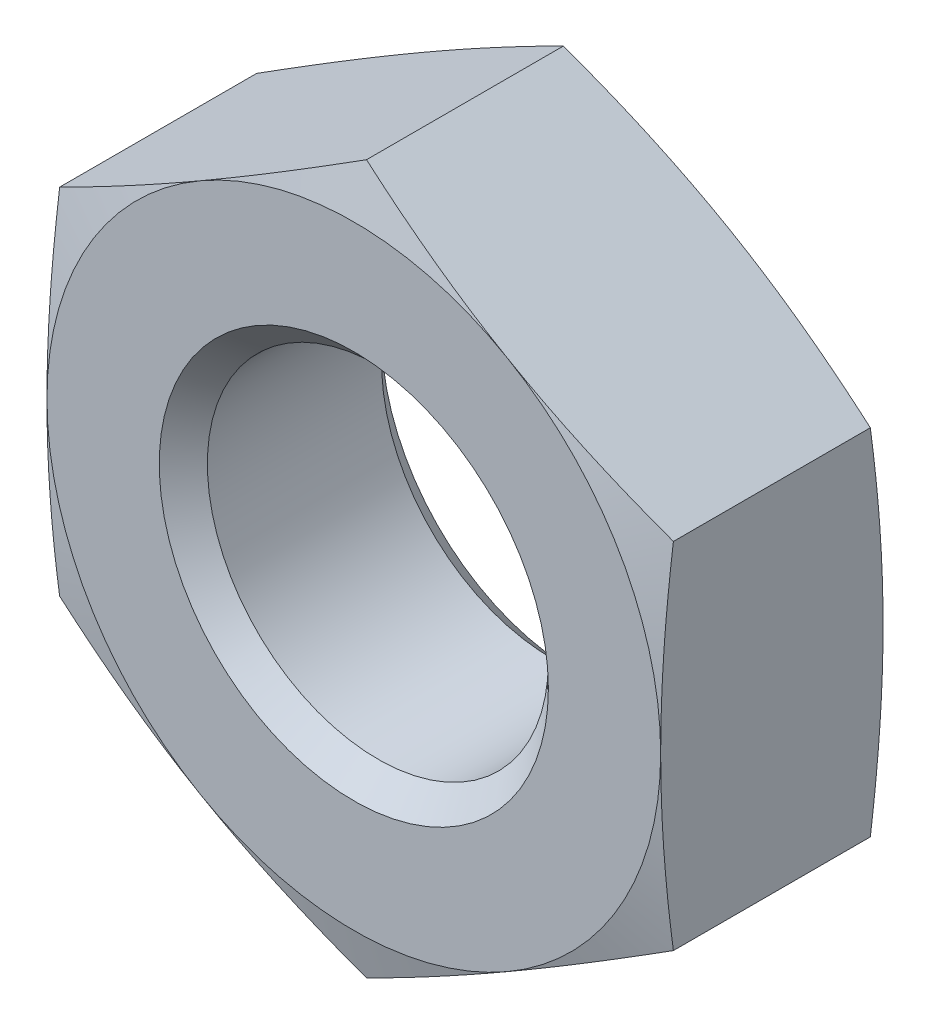
ISO-10303-21;
HEADER;
FILE_DESCRIPTION(('STEP AP214'),'2;1');
FILE_NAME('part.step','',(''),(''),'','','');
FILE_SCHEMA(('AUTOMOTIVE_DESIGN { 1 0 10303 214 1 1 1 1 }'));
ENDSEC;
DATA;
#1=APPLICATION_CONTEXT('core data for automotive mechanical design processes');
#2=APPLICATION_PROTOCOL_DEFINITION('international standard','automotive_design',2000,#1);
#3=PRODUCT_CONTEXT('',#1,'mechanical');
#4=PRODUCT('Part','Part','',(#3));
#5=PRODUCT_RELATED_PRODUCT_CATEGORY('part','',(#4));
#6=PRODUCT_DEFINITION_FORMATION('','',#4);
#7=PRODUCT_DEFINITION_CONTEXT('part definition',#1,'design');
#8=PRODUCT_DEFINITION('design','',#6,#7);
#9=PRODUCT_DEFINITION_SHAPE('','',#8);
#10=(LENGTH_UNIT() NAMED_UNIT(*) SI_UNIT(.MILLI.,.METRE.));
#11=(NAMED_UNIT(*) PLANE_ANGLE_UNIT() SI_UNIT($,.RADIAN.));
#12=(NAMED_UNIT(*) SI_UNIT($,.STERADIAN.) SOLID_ANGLE_UNIT());
#13=UNCERTAINTY_MEASURE_WITH_UNIT(LENGTH_MEASURE(1.E-05),#10,'distance_accuracy_value','');
#14=(GEOMETRIC_REPRESENTATION_CONTEXT(3) GLOBAL_UNCERTAINTY_ASSIGNED_CONTEXT((#13)) GLOBAL_UNIT_ASSIGNED_CONTEXT((#10,
#11,#12)) REPRESENTATION_CONTEXT('',''));
#15=CARTESIAN_POINT('',(0.,0.,0.));
#16=DIRECTION('',(0.,0.,1.));
#17=DIRECTION('',(1.,0.,0.));
#18=AXIS2_PLACEMENT_3D('',#15,#16,#17);
#19=CARTESIAN_POINT('',(0.,0.,0.));
#20=DIRECTION('',(0.,0.,-1.));
#21=DIRECTION('',(-1.,0.,0.));
#22=AXIS2_PLACEMENT_3D('',#19,#20,#21);
#23=PLANE('',#22);
#24=CARTESIAN_POINT('',(0.,0.,0.));
#25=DIRECTION('',(0.,0.,1.));
#26=DIRECTION('',(1.,0.,0.));
#27=AXIS2_PLACEMENT_3D('',#24,#25,#26);
#28=CIRCLE('',#27,8.763);
#29=CARTESIAN_POINT('',(8.763,0.,0.));
#30=VERTEX_POINT('',#29);
#31=CARTESIAN_POINT('',(4.38149999999967,7.58898061336304,0.));
#32=VERTEX_POINT('',#31);
#33=EDGE_CURVE('E11',#30,#32,#28,.T.);
#34=ORIENTED_EDGE('',*,*,#33,.T.);
#35=CARTESIAN_POINT('',(-4.38149999999967,7.58898061336304,0.));
#36=VERTEX_POINT('',#35);
#37=EDGE_CURVE('E43',#32,#36,#28,.T.);
#38=ORIENTED_EDGE('',*,*,#37,.T.);
#39=CARTESIAN_POINT('',(-8.763,0.,0.));
#40=VERTEX_POINT('',#39);
#41=EDGE_CURVE('E327',#36,#40,#28,.T.);
#42=ORIENTED_EDGE('',*,*,#41,.T.);
#43=CARTESIAN_POINT('',(-4.38149999999967,-7.58898061336305,0.));
#44=VERTEX_POINT('',#43);
#45=EDGE_CURVE('E326',#40,#44,#28,.T.);
#46=ORIENTED_EDGE('',*,*,#45,.T.);
#47=CARTESIAN_POINT('',(4.38149999999967,-7.58898061336304,0.));
#48=VERTEX_POINT('',#47);
#49=EDGE_CURVE('E320',#44,#48,#28,.T.);
#50=ORIENTED_EDGE('',*,*,#49,.T.);
#51=EDGE_CURVE('E44',#48,#30,#28,.T.);
#52=ORIENTED_EDGE('',*,*,#51,.T.);
#53=EDGE_LOOP('',(#34,#38,#42,#46,#50,#52));
#54=FACE_BOUND('',#53,.T.);
#55=CARTESIAN_POINT('',(0.,0.,0.));
#56=DIRECTION('',(0.,0.,1.));
#57=DIRECTION('',(1.,0.,0.));
#58=AXIS2_PLACEMENT_3D('',#55,#56,#57);
#59=CIRCLE('',#58,5.55625);
#60=CARTESIAN_POINT('',(5.55625,0.,0.));
#61=VERTEX_POINT('',#60);
#62=EDGE_CURVE('E185',#61,#61,#59,.T.);
#63=ORIENTED_EDGE('',*,*,#62,.F.);
#64=EDGE_LOOP('',(#63));
#65=FACE_BOUND('',#64,.T.);
#66=ADVANCED_FACE('F36',(#54,#65),#23,.F.);
#67=CARTESIAN_POINT('',(0.,8.763,-6.35));
#68=DIRECTION('',(0.,0.,1.));
#69=DIRECTION('',(1.,0.,0.));
#70=AXIS2_PLACEMENT_3D('',#67,#68,#69);
#71=PLANE('',#70);
#72=CARTESIAN_POINT('',(0.,0.,-6.35));
#73=DIRECTION('',(0.,0.,1.));
#74=DIRECTION('',(1.,0.,0.));
#75=AXIS2_PLACEMENT_3D('',#72,#73,#74);
#76=CIRCLE('',#75,8.763);
#77=CARTESIAN_POINT('',(8.763,0.,-6.35));
#78=VERTEX_POINT('',#77);
#79=CARTESIAN_POINT('',(4.38149999999967,7.58898061336304,-6.35));
#80=VERTEX_POINT('',#79);
#81=EDGE_CURVE('E323',#78,#80,#76,.T.);
#82=ORIENTED_EDGE('',*,*,#81,.F.);
#83=CARTESIAN_POINT('',(4.38149999999967,-7.58898061336305,-6.35));
#84=VERTEX_POINT('',#83);
#85=EDGE_CURVE('E359',#84,#78,#76,.T.);
#86=ORIENTED_EDGE('',*,*,#85,.F.);
#87=CARTESIAN_POINT('',(-4.38149999999967,-7.58898061336305,-6.35));
#88=VERTEX_POINT('',#87);
#89=EDGE_CURVE('E143',#88,#84,#76,.T.);
#90=ORIENTED_EDGE('',*,*,#89,.F.);
#91=CARTESIAN_POINT('',(-8.763,0.,-6.35));
#92=VERTEX_POINT('',#91);
#93=EDGE_CURVE('E357',#92,#88,#76,.T.);
#94=ORIENTED_EDGE('',*,*,#93,.F.);
#95=CARTESIAN_POINT('',(-4.38149999999967,7.58898061336304,-6.35));
#96=VERTEX_POINT('',#95);
#97=EDGE_CURVE('E353',#96,#92,#76,.T.);
#98=ORIENTED_EDGE('',*,*,#97,.F.);
#99=EDGE_CURVE('E356',#80,#96,#76,.T.);
#100=ORIENTED_EDGE('',*,*,#99,.F.);
#101=EDGE_LOOP('',(#82,#86,#90,#94,#98,#100));
#102=FACE_BOUND('',#101,.T.);
#103=CARTESIAN_POINT('',(0.,0.,-6.35));
#104=DIRECTION('',(0.,0.,1.));
#105=DIRECTION('',(1.,0.,0.));
#106=AXIS2_PLACEMENT_3D('',#103,#104,#105);
#107=CIRCLE('',#106,5.55625);
#108=CARTESIAN_POINT('',(5.55625,0.,-6.35));
#109=VERTEX_POINT('',#108);
#110=EDGE_CURVE('E205',#109,#109,#107,.T.);
#111=ORIENTED_EDGE('',*,*,#110,.T.);
#112=EDGE_LOOP('',(#111));
#113=FACE_BOUND('',#112,.T.);
#114=ADVANCED_FACE('F209',(#102,#113),#71,.F.);
#115=CARTESIAN_POINT('',(0.,0.,-0.46960775465478));
#116=DIRECTION('',(0.,0.,-1.));
#117=DIRECTION('',(-1.,0.,0.));
#118=AXIS2_PLACEMENT_3D('',#115,#116,#117);
#119=CONICAL_SURFACE('',#118,10.5156,1.30899693899575);
#120=CARTESIAN_POINT('',(-8.763,-13.3837702899199,-1.93844049434777));
#121=CARTESIAN_POINT('',(-8.763,-12.9862181649756,-1.84934412146664));
#122=CARTESIAN_POINT('',(-8.763,-12.5884173836727,-1.76133740130551));
#123=CARTESIAN_POINT('',(-8.763,-11.792196389762,-1.58809143425452));
#124=CARTESIAN_POINT('',(-8.763,-11.3937761511781,-1.50285230688892));
#125=CARTESIAN_POINT('',(-8.763,-10.5958372220428,-1.33565551527808));
#126=CARTESIAN_POINT('',(-8.763,-10.1963178373504,-1.2537011520015));
#127=CARTESIAN_POINT('',(-8.763,-9.39644750668763,-1.09395849709296));
#128=CARTESIAN_POINT('',(-8.763,-8.99609656776501,-1.0161701703002));
#129=CARTESIAN_POINT('',(-8.763,-8.19761138133054,-0.866351145193688));
#130=CARTESIAN_POINT('',(-8.763,-7.7994848436043,-0.794279558247119));
#131=CARTESIAN_POINT('',(-8.763,-7.00214580050872,-0.656428589692995));
#132=CARTESIAN_POINT('',(-8.763,-6.60293331923369,-0.590649069632863));
#133=CARTESIAN_POINT('',(-8.763,-5.80334489207022,-0.466863323728334));
#134=CARTESIAN_POINT('',(-8.763,-5.40296909562369,-0.408856140943656));
#135=CARTESIAN_POINT('',(-8.763,-4.60094342795015,-0.302324446329907));
#136=CARTESIAN_POINT('',(-8.763,-4.19929355552988,-0.253799943384739));
#137=CARTESIAN_POINT('',(-8.763,-3.39018837962683,-0.167607648360078));
#138=CARTESIAN_POINT('',(-8.763,-2.98271903379171,-0.130069718559839));
#139=CARTESIAN_POINT('',(-8.763,-2.16675595793937,-0.0684401455251191));
#140=CARTESIAN_POINT('',(-8.763,-1.75826225163068,-0.0443481939203276));
#141=CARTESIAN_POINT('',(-8.763,-0.940843012454314,-0.0110157171231371));
#142=CARTESIAN_POINT('',(-8.763,-0.531917760453649,-0.00176844288722009));
#143=CARTESIAN_POINT('',(-8.763,0.285991550994262,0.00130613861734006));
#144=CARTESIAN_POINT('',(-8.763,0.694975610390509,-0.00486654082138649));
#145=CARTESIAN_POINT('',(-8.763,1.51391612064036,-0.0322847373045139));
#146=CARTESIAN_POINT('',(-8.763,1.92387070253099,-0.0535849596048437));
#147=CARTESIAN_POINT('',(-8.763,2.74281574927551,-0.110042389929746));
#148=CARTESIAN_POINT('',(-8.763,3.15180619258268,-0.145199904740592));
#149=CARTESIAN_POINT('',(-8.763,3.96881951949812,-0.22759601433524));
#150=CARTESIAN_POINT('',(-8.763,4.37684159561712,-0.27484249329322));
#151=CARTESIAN_POINT('',(-8.763,5.19157263502939,-0.379450538965934));
#152=CARTESIAN_POINT('',(-8.763,5.59828159419586,-0.436812137438485));
#153=CARTESIAN_POINT('',(-8.763,6.38354017699799,-0.555743213369239));
#154=CARTESIAN_POINT('',(-8.763,6.76217092727843,-0.616782449788006));
#155=CARTESIAN_POINT('',(-8.763,7.51843456139871,-0.744785447310177));
#156=CARTESIAN_POINT('',(-8.763,7.89606741772422,-0.81174937005183));
#157=CARTESIAN_POINT('',(-8.763,8.65047296826483,-0.950519483254617));
#158=CARTESIAN_POINT('',(-8.763,9.02724558226135,-1.02232610765112));
#159=CARTESIAN_POINT('',(-8.763,9.78001835031701,-1.16989133180626));
#160=CARTESIAN_POINT('',(-8.763,10.1560184943023,-1.24564998276803));
#161=CARTESIAN_POINT('',(-8.763,10.9074351141636,-1.40042140295396));
#162=CARTESIAN_POINT('',(-8.763,11.2828514390693,-1.47943490312786));
#163=CARTESIAN_POINT('',(-8.763,12.0331126862545,-1.64013356208892));
#164=CARTESIAN_POINT('',(-8.763,12.4079576051979,-1.72181873641227));
#165=CARTESIAN_POINT('',(-8.763,13.5317125358089,-1.97016081007156));
#166=CARTESIAN_POINT('',(-8.763,14.279893613434,-2.14011488200832));
#167=CARTESIAN_POINT('',(-8.763,15.7674818810842,-2.48445565533592));
#168=CARTESIAN_POINT('',(-8.763,16.5069030435853,-2.65878238911854));
#169=CARTESIAN_POINT('',(-8.763,17.9847143075208,-3.01180428588832));
#170=CARTESIAN_POINT('',(-8.763,18.7231043899121,-3.19049952845809));
#171=CARTESIAN_POINT('',(-8.763,20.1981842908095,-3.5508912153922));
#172=CARTESIAN_POINT('',(-8.763,20.9348750830499,-3.73258368406784));
#173=CARTESIAN_POINT('',(-8.763,22.4076149635126,-4.09844959544106));
#174=CARTESIAN_POINT('',(-8.763,23.1436640721096,-4.2826229560661));
#175=CARTESIAN_POINT('',(-8.763,23.8794895947639,-4.46767540457424));
#176=B_SPLINE_CURVE_WITH_KNOTS('',3,(#120,#121,#122,#123,#124,#125,#126,#127,#128,#129,#130,
#131,#132,#133,#134,#135,#136,#137,#138,#139,#140,#141,#142,#143,#144,#145,#146,#147,#148,#149,
#150,#151,#152,#153,#154,#155,#156,#157,#158,#159,#160,#161,#162,#163,#164,#165,#166,#167,#168,
#169,#170,#171,#172,#173,#174,#175),.UNSPECIFIED.,.F.,.F.,(4,2,2,2,2,2,2,2,2,2,2,2,2,2,2,2,2,2,
2,2,2,2,2,2,2,2,2,4),(0.,1.22224582683769,2.44454436889226,3.66804192292283,4.89152914916844,
6.10528101679588,7.31900617050677,8.53258175121245,9.74615846885785,10.9735486088279,
12.2009105986532,13.4277144175138,14.6545171788198,15.8857791275233,17.1170683366373,
18.3491626232361,19.5812607782343,20.7317631716272,21.8822969628969,23.0329339862866,
24.183585921232,25.3344976849745,26.4854161426325,28.7870971026554,31.0661607154404,
33.345265877679,35.6215585602892,37.8977761229223),.UNSPECIFIED.);
#177=CARTESIAN_POINT('',(-8.763,-5.0593204089087,-0.363242862360831));
#178=VERTEX_POINT('',#177);
#179=EDGE_CURVE('E340',#178,#40,#176,.T.);
#180=ORIENTED_EDGE('',*,*,#179,.F.);
#181=CARTESIAN_POINT('',(0.0002,-10.1187562878708,-0.363273802998012));
#182=CARTESIAN_POINT('',(-0.363721959861376,-9.90864584638087,-0.306951649740606));
#183=CARTESIAN_POINT('',(-0.728303743849241,-9.69815445525386,-0.25582046240115));
#184=CARTESIAN_POINT('',(-1.45875483719337,-9.2764283198818,-0.165987801407371));
#185=CARTESIAN_POINT('',(-1.82462460868095,-9.06519330882512,-0.127291376259173));
#186=CARTESIAN_POINT('',(-2.55543344890334,-8.64326062819659,-0.0645872736735056));
#187=CARTESIAN_POINT('',(-2.92036757610492,-8.4325658116203,-0.0405048202732212));
#188=CARTESIAN_POINT('',(-3.65070120469056,-8.01090749455818,-0.00821271888188998));
#189=CARTESIAN_POINT('',(-4.01610060234528,-7.79994405396051,0.));
#190=CARTESIAN_POINT('',(-4.74689939765473,-7.37801717276518,0.));
#191=CARTESIAN_POINT('',(-5.11229879530945,-7.16705373216752,-0.00821271888190999));
#192=CARTESIAN_POINT('',(-5.84263242389508,-6.7453954151054,-0.0405048202732604));
#193=CARTESIAN_POINT('',(-6.20756655109666,-6.5347005985291,-0.064587273673554));
#194=CARTESIAN_POINT('',(-6.93837539131905,-6.11276791790058,-0.127291376259239));
#195=CARTESIAN_POINT('',(-7.30424516280663,-5.9015329068439,-0.165987801407446));
#196=CARTESIAN_POINT('',(-8.03469625615076,-5.47980677147184,-0.255820462401241));
#197=CARTESIAN_POINT('',(-8.39927804013863,-5.26931538034483,-0.306951649740704));
#198=CARTESIAN_POINT('',(-8.7632,-5.05920493885486,-0.363273802998116));
#199=B_SPLINE_CURVE_WITH_KNOTS('',3,(#181,#182,#183,#184,#185,#186,#187,#188,#189,#190,#191,
#192,#193,#194,#195,#196,#197,#198),.UNSPECIFIED.,.F.,.F.,(4,2,2,2,2,2,2,2,4),(0.,
1.27200216485818,2.5445201112656,3.81047076613488,5.07617642725258,6.34188208837027,
7.60783274323955,8.88035068964697,10.1523528545052),.UNSPECIFIED.);
#200=EDGE_CURVE('E154',#44,#178,#199,.T.);
#201=ORIENTED_EDGE('',*,*,#200,.F.);
#202=ORIENTED_EDGE('',*,*,#45,.F.);
#203=EDGE_LOOP('',(#180,#201,#202));
#204=FACE_BOUND('',#203,.T.);
#205=ADVANCED_FACE('F227',(#204),#119,.T.);
#206=CARTESIAN_POINT('',(-8.763,5.0593204089087,-0.363242862360831));
#207=VERTEX_POINT('',#206);
#208=EDGE_CURVE('E337',#40,#207,#176,.T.);
#209=ORIENTED_EDGE('',*,*,#208,.F.);
#210=ORIENTED_EDGE('',*,*,#41,.F.);
#211=CARTESIAN_POINT('',(-8.7632,5.05920493885486,-0.363273802998116));
#212=CARTESIAN_POINT('',(-8.39927804013863,5.26931538034483,-0.306951649740704));
#213=CARTESIAN_POINT('',(-8.03469625615076,5.47980677147184,-0.255820462401241));
#214=CARTESIAN_POINT('',(-7.30424516280663,5.9015329068439,-0.165987801407446));
#215=CARTESIAN_POINT('',(-6.93837539131905,6.11276791790058,-0.127291376259239));
#216=CARTESIAN_POINT('',(-6.20756655109666,6.5347005985291,-0.064587273673554));
#217=CARTESIAN_POINT('',(-5.84263242389508,6.7453954151054,-0.0405048202732606));
#218=CARTESIAN_POINT('',(-5.11229879530945,7.16705373216752,-0.00821271888191033));
#219=CARTESIAN_POINT('',(-4.74689939765473,7.37801717276519,0.));
#220=CARTESIAN_POINT('',(-4.01610060234528,7.79994405396051,0.));
#221=CARTESIAN_POINT('',(-3.65070120469056,8.01090749455818,-0.00821271888188964));
#222=CARTESIAN_POINT('',(-2.92036757610492,8.4325658116203,-0.0405048202732208));
#223=CARTESIAN_POINT('',(-2.55543344890334,8.64326062819659,-0.0645872736735054));
#224=CARTESIAN_POINT('',(-1.82462460868095,9.06519330882512,-0.127291376259173));
#225=CARTESIAN_POINT('',(-1.45875483719337,9.2764283198818,-0.165987801407371));
#226=CARTESIAN_POINT('',(-0.728303743849241,9.69815445525386,-0.255820462401151));
#227=CARTESIAN_POINT('',(-0.363721959861376,9.90864584638088,-0.306951649740607));
#228=CARTESIAN_POINT('',(0.000200000000000257,10.1187562878708,-0.363273802998012));
#229=B_SPLINE_CURVE_WITH_KNOTS('',3,(#211,#212,#213,#214,#215,#216,#217,#218,#219,#220,#221,
#222,#223,#224,#225,#226,#227,#228),.UNSPECIFIED.,.F.,.F.,(4,2,2,2,2,2,2,2,4),(0.,
1.27200216485818,2.5445201112656,3.81047076613488,5.07617642725257,6.34188208837027,
7.60783274323955,8.88035068964697,10.1523528545052),.UNSPECIFIED.);
#230=EDGE_CURVE('E265',#207,#36,#229,.T.);
#231=ORIENTED_EDGE('',*,*,#230,.F.);
#232=EDGE_LOOP('',(#209,#210,#231));
#233=FACE_BOUND('',#232,.T.);
#234=ADVANCED_FACE('F274',(#233),#119,.T.);
#235=CARTESIAN_POINT('',(0.,10.118640817817,-0.363242862360728));
#236=VERTEX_POINT('',#235);
#237=EDGE_CURVE('E260',#36,#236,#229,.T.);
#238=ORIENTED_EDGE('',*,*,#237,.F.);
#239=ORIENTED_EDGE('',*,*,#37,.F.);
#240=CARTESIAN_POINT('',(-0.0002,10.1187562878708,-0.363273802998012));
#241=CARTESIAN_POINT('',(0.363721959861376,9.90864584638087,-0.306951649740606));
#242=CARTESIAN_POINT('',(0.728303743849241,9.69815445525386,-0.25582046240115));
#243=CARTESIAN_POINT('',(1.45875483719337,9.2764283198818,-0.165987801407371));
#244=CARTESIAN_POINT('',(1.82462460868095,9.06519330882512,-0.127291376259173));
#245=CARTESIAN_POINT('',(2.55543344890334,8.64326062819659,-0.0645872736735056));
#246=CARTESIAN_POINT('',(2.92036757610492,8.4325658116203,-0.0405048202732212));
#247=CARTESIAN_POINT('',(3.65070120469056,8.01090749455818,-0.00821271888188998));
#248=CARTESIAN_POINT('',(4.01610060234528,7.79994405396051,0.));
#249=CARTESIAN_POINT('',(4.74689939765473,7.37801717276518,0.));
#250=CARTESIAN_POINT('',(5.11229879530945,7.16705373216752,-0.00821271888190999));
#251=CARTESIAN_POINT('',(5.84263242389508,6.7453954151054,-0.0405048202732604));
#252=CARTESIAN_POINT('',(6.20756655109666,6.5347005985291,-0.064587273673554));
#253=CARTESIAN_POINT('',(6.93837539131905,6.11276791790058,-0.127291376259239));
#254=CARTESIAN_POINT('',(7.30424516280663,5.9015329068439,-0.165987801407446));
#255=CARTESIAN_POINT('',(8.03469625615076,5.47980677147184,-0.255820462401241));
#256=CARTESIAN_POINT('',(8.39927804013863,5.26931538034483,-0.306951649740704));
#257=CARTESIAN_POINT('',(8.7632,5.05920493885486,-0.363273802998116));
#258=B_SPLINE_CURVE_WITH_KNOTS('',3,(#240,#241,#242,#243,#244,#245,#246,#247,#248,#249,#250,
#251,#252,#253,#254,#255,#256,#257),.UNSPECIFIED.,.F.,.F.,(4,2,2,2,2,2,2,2,4),(0.,
1.27200216485818,2.5445201112656,3.81047076613488,5.07617642725258,6.34188208837027,
7.60783274323955,8.88035068964697,10.1523528545052),.UNSPECIFIED.);
#259=EDGE_CURVE('E292',#236,#32,#258,.T.);
#260=ORIENTED_EDGE('',*,*,#259,.F.);
#261=EDGE_LOOP('',(#238,#239,#260));
#262=FACE_BOUND('',#261,.T.);
#263=ADVANCED_FACE('F333',(#262),#119,.T.);
#264=CARTESIAN_POINT('',(8.763,5.0593204089087,-0.363242862360831));
#265=VERTEX_POINT('',#264);
#266=EDGE_CURVE('E288',#32,#265,#258,.T.);
#267=ORIENTED_EDGE('',*,*,#266,.F.);
#268=ORIENTED_EDGE('',*,*,#33,.F.);
#269=CARTESIAN_POINT('',(8.763,-13.3837702899199,-1.93844049434777));
#270=CARTESIAN_POINT('',(8.763,-12.9862181649756,-1.84934412146664));
#271=CARTESIAN_POINT('',(8.763,-12.5884173836727,-1.76133740130551));
#272=CARTESIAN_POINT('',(8.763,-11.792196389762,-1.58809143425452));
#273=CARTESIAN_POINT('',(8.763,-11.3937761511781,-1.50285230688892));
#274=CARTESIAN_POINT('',(8.763,-10.5958372220428,-1.33565551527808));
#275=CARTESIAN_POINT('',(8.763,-10.1963178373504,-1.2537011520015));
#276=CARTESIAN_POINT('',(8.763,-9.39644750668763,-1.09395849709296));
#277=CARTESIAN_POINT('',(8.763,-8.99609656776501,-1.0161701703002));
#278=CARTESIAN_POINT('',(8.763,-8.19761138133054,-0.866351145193688));
#279=CARTESIAN_POINT('',(8.763,-7.7994848436043,-0.794279558247119));
#280=CARTESIAN_POINT('',(8.763,-7.00214580050872,-0.656428589692995));
#281=CARTESIAN_POINT('',(8.763,-6.60293331923369,-0.590649069632863));
#282=CARTESIAN_POINT('',(8.763,-5.80334489207022,-0.466863323728334));
#283=CARTESIAN_POINT('',(8.763,-5.40296909562369,-0.408856140943656));
#284=CARTESIAN_POINT('',(8.763,-4.60094342795015,-0.302324446329907));
#285=CARTESIAN_POINT('',(8.763,-4.19929355552988,-0.253799943384739));
#286=CARTESIAN_POINT('',(8.763,-3.39018837962683,-0.167607648360078));
#287=CARTESIAN_POINT('',(8.763,-2.98271903379171,-0.130069718559839));
#288=CARTESIAN_POINT('',(8.763,-2.16675595793937,-0.0684401455251191));
#289=CARTESIAN_POINT('',(8.763,-1.75826225163068,-0.0443481939203276));
#290=CARTESIAN_POINT('',(8.763,-0.940843012454314,-0.0110157171231371));
#291=CARTESIAN_POINT('',(8.763,-0.531917760453649,-0.00176844288722009));
#292=CARTESIAN_POINT('',(8.763,0.285991550994262,0.00130613861734006));
#293=CARTESIAN_POINT('',(8.763,0.694975610390509,-0.00486654082138649));
#294=CARTESIAN_POINT('',(8.763,1.51391612064036,-0.0322847373045139));
#295=CARTESIAN_POINT('',(8.763,1.92387070253099,-0.0535849596048437));
#296=CARTESIAN_POINT('',(8.763,2.74281574927551,-0.110042389929746));
#297=CARTESIAN_POINT('',(8.763,3.15180619258268,-0.145199904740592));
#298=CARTESIAN_POINT('',(8.763,3.96881951949812,-0.22759601433524));
#299=CARTESIAN_POINT('',(8.763,4.37684159561712,-0.27484249329322));
#300=CARTESIAN_POINT('',(8.763,5.19157263502939,-0.379450538965934));
#301=CARTESIAN_POINT('',(8.763,5.59828159419586,-0.436812137438485));
#302=CARTESIAN_POINT('',(8.763,6.38354017699799,-0.555743213369239));
#303=CARTESIAN_POINT('',(8.763,6.76217092727843,-0.616782449788006));
#304=CARTESIAN_POINT('',(8.763,7.51843456139871,-0.744785447310177));
#305=CARTESIAN_POINT('',(8.763,7.89606741772422,-0.81174937005183));
#306=CARTESIAN_POINT('',(8.763,8.65047296826483,-0.950519483254617));
#307=CARTESIAN_POINT('',(8.763,9.02724558226135,-1.02232610765112));
#308=CARTESIAN_POINT('',(8.763,9.78001835031701,-1.16989133180626));
#309=CARTESIAN_POINT('',(8.763,10.1560184943023,-1.24564998276803));
#310=CARTESIAN_POINT('',(8.763,10.9074351141636,-1.40042140295396));
#311=CARTESIAN_POINT('',(8.763,11.2828514390693,-1.47943490312786));
#312=CARTESIAN_POINT('',(8.763,12.0331126862545,-1.64013356208892));
#313=CARTESIAN_POINT('',(8.763,12.4079576051979,-1.72181873641227));
#314=CARTESIAN_POINT('',(8.763,13.5317125358089,-1.97016081007156));
#315=CARTESIAN_POINT('',(8.763,14.279893613434,-2.14011488200832));
#316=CARTESIAN_POINT('',(8.763,15.7674818810842,-2.48445565533592));
#317=CARTESIAN_POINT('',(8.763,16.5069030435853,-2.65878238911854));
#318=CARTESIAN_POINT('',(8.763,17.9847143075208,-3.01180428588832));
#319=CARTESIAN_POINT('',(8.763,18.7231043899121,-3.19049952845809));
#320=CARTESIAN_POINT('',(8.763,20.1981842908095,-3.5508912153922));
#321=CARTESIAN_POINT('',(8.763,20.9348750830499,-3.73258368406784));
#322=CARTESIAN_POINT('',(8.763,22.4076149635126,-4.09844959544106));
#323=CARTESIAN_POINT('',(8.763,23.1436640721096,-4.2826229560661));
#324=CARTESIAN_POINT('',(8.763,23.8794895947639,-4.46767540457424));
#325=B_SPLINE_CURVE_WITH_KNOTS('',3,(#269,#270,#271,#272,#273,#274,#275,#276,#277,#278,#279,
#280,#281,#282,#283,#284,#285,#286,#287,#288,#289,#290,#291,#292,#293,#294,#295,#296,#297,#298,
#299,#300,#301,#302,#303,#304,#305,#306,#307,#308,#309,#310,#311,#312,#313,#314,#315,#316,#317,
#318,#319,#320,#321,#322,#323,#324),.UNSPECIFIED.,.F.,.F.,(4,2,2,2,2,2,2,2,2,2,2,2,2,2,2,2,2,2,
2,2,2,2,2,2,2,2,2,4),(0.,1.22224582683769,2.44454436889226,3.66804192292283,4.89152914916844,
6.10528101679588,7.31900617050677,8.53258175121245,9.74615846885785,10.9735486088279,
12.2009105986532,13.4277144175138,14.6545171788198,15.8857791275233,17.1170683366373,
18.3491626232361,19.5812607782343,20.7317631716272,21.8822969628969,23.0329339862866,
24.183585921232,25.3344976849745,26.4854161426325,28.7870971026554,31.0661607154404,
33.345265877679,35.6215585602892,37.8977761229223),.UNSPECIFIED.);
#326=EDGE_CURVE('E298',#265,#30,#325,.F.);
#327=ORIENTED_EDGE('',*,*,#326,.F.);
#328=EDGE_LOOP('',(#267,#268,#327));
#329=FACE_BOUND('',#328,.T.);
#330=ADVANCED_FACE('F374',(#329),#119,.T.);
#331=CARTESIAN_POINT('',(8.763,-5.0593204089087,-0.363242862360831));
#332=VERTEX_POINT('',#331);
#333=EDGE_CURVE('E283',#30,#332,#325,.F.);
#334=ORIENTED_EDGE('',*,*,#333,.F.);
#335=ORIENTED_EDGE('',*,*,#51,.F.);
#336=CARTESIAN_POINT('',(8.7632,-5.05920493885486,-0.363273802998116));
#337=CARTESIAN_POINT('',(8.39927804013863,-5.26931538034483,-0.306951649740704));
#338=CARTESIAN_POINT('',(8.03469625615076,-5.47980677147184,-0.255820462401241));
#339=CARTESIAN_POINT('',(7.30424516280663,-5.9015329068439,-0.165987801407446));
#340=CARTESIAN_POINT('',(6.93837539131905,-6.11276791790058,-0.127291376259239));
#341=CARTESIAN_POINT('',(6.20756655109666,-6.5347005985291,-0.064587273673554));
#342=CARTESIAN_POINT('',(5.84263242389508,-6.7453954151054,-0.0405048202732606));
#343=CARTESIAN_POINT('',(5.11229879530945,-7.16705373216752,-0.00821271888191033));
#344=CARTESIAN_POINT('',(4.74689939765473,-7.37801717276519,0.));
#345=CARTESIAN_POINT('',(4.01610060234528,-7.79994405396051,0.));
#346=CARTESIAN_POINT('',(3.65070120469056,-8.01090749455818,-0.00821271888188964));
#347=CARTESIAN_POINT('',(2.92036757610492,-8.4325658116203,-0.0405048202732208));
#348=CARTESIAN_POINT('',(2.55543344890334,-8.64326062819659,-0.0645872736735054));
#349=CARTESIAN_POINT('',(1.82462460868095,-9.06519330882512,-0.127291376259173));
#350=CARTESIAN_POINT('',(1.45875483719337,-9.2764283198818,-0.165987801407371));
#351=CARTESIAN_POINT('',(0.728303743849241,-9.69815445525386,-0.255820462401151));
#352=CARTESIAN_POINT('',(0.363721959861376,-9.90864584638088,-0.306951649740607));
#353=CARTESIAN_POINT('',(-0.000200000000000257,-10.1187562878708,-0.363273802998012));
#354=B_SPLINE_CURVE_WITH_KNOTS('',3,(#336,#337,#338,#339,#340,#341,#342,#343,#344,#345,#346,
#347,#348,#349,#350,#351,#352,#353),.UNSPECIFIED.,.F.,.F.,(4,2,2,2,2,2,2,2,4),(0.,
1.27200216485818,2.5445201112656,3.81047076613488,5.07617642725257,6.34188208837027,
7.60783274323955,8.88035068964697,10.1523528545052),.UNSPECIFIED.);
#355=EDGE_CURVE('E146',#332,#48,#354,.T.);
#356=ORIENTED_EDGE('',*,*,#355,.F.);
#357=EDGE_LOOP('',(#334,#335,#356));
#358=FACE_BOUND('',#357,.T.);
#359=ADVANCED_FACE('F322',(#358),#119,.T.);
#360=CARTESIAN_POINT('',(0.,-10.118640817817,-0.363242862360728));
#361=VERTEX_POINT('',#360);
#362=EDGE_CURVE('E138',#48,#361,#354,.T.);
#363=ORIENTED_EDGE('',*,*,#362,.F.);
#364=ORIENTED_EDGE('',*,*,#49,.F.);
#365=EDGE_CURVE('E51',#361,#44,#199,.T.);
#366=ORIENTED_EDGE('',*,*,#365,.F.);
#367=EDGE_LOOP('',(#363,#364,#366));
#368=FACE_BOUND('',#367,.T.);
#369=ADVANCED_FACE('F276',(#368),#119,.T.);
#370=CARTESIAN_POINT('',(-8.763,5.0593204089087,-6.35));
#371=DIRECTION('',(-1.,0.,0.));
#372=DIRECTION('',(0.,0.,1.));
#373=AXIS2_PLACEMENT_3D('',#370,#371,#372);
#374=PLANE('',#373);
#375=ORIENTED_EDGE('',*,*,#179,.T.);
#376=ORIENTED_EDGE('',*,*,#208,.T.);
#377=DIRECTION('',(0.,0.,1.));
#378=VECTOR('',#377,1.);
#379=CARTESIAN_POINT('',(-8.763,5.0593204089087,-6.35));
#380=LINE('',#379,#378);
#381=CARTESIAN_POINT('',(-8.763,5.0593204089087,-5.98675713763915));
#382=VERTEX_POINT('',#381);
#383=EDGE_CURVE('E131',#382,#207,#380,.T.);
#384=ORIENTED_EDGE('',*,*,#383,.F.);
#385=CARTESIAN_POINT('',(-8.763,-13.3837702899199,-4.41155950565215));
#386=CARTESIAN_POINT('',(-8.763,-12.9862181649756,-4.50065587853328));
#387=CARTESIAN_POINT('',(-8.763,-12.5884173836727,-4.58866259869441));
#388=CARTESIAN_POINT('',(-8.763,-11.792196389762,-4.76190856574541));
#389=CARTESIAN_POINT('',(-8.763,-11.3937761511781,-4.84714769311101));
#390=CARTESIAN_POINT('',(-8.763,-10.5958372220428,-5.01434448472186));
#391=CARTESIAN_POINT('',(-8.763,-10.1963178373504,-5.09629884799844));
#392=CARTESIAN_POINT('',(-8.763,-9.39644750668763,-5.25604150290699));
#393=CARTESIAN_POINT('',(-8.763,-8.99609656776501,-5.33382982969976));
#394=CARTESIAN_POINT('',(-8.763,-8.19761138133054,-5.48364885480628));
#395=CARTESIAN_POINT('',(-8.763,-7.7994848436043,-5.55572044175285));
#396=CARTESIAN_POINT('',(-8.763,-7.00214580050872,-5.69357141030698));
#397=CARTESIAN_POINT('',(-8.763,-6.6029333192337,-5.75935093036711));
#398=CARTESIAN_POINT('',(-8.763,-5.80334489207023,-5.88313667627165));
#399=CARTESIAN_POINT('',(-8.763,-5.4029690956237,-5.94114385905633));
#400=CARTESIAN_POINT('',(-8.763,-4.60094342795016,-6.04767555367008));
#401=CARTESIAN_POINT('',(-8.763,-4.19929355552989,-6.09620005661525));
#402=CARTESIAN_POINT('',(-8.763,-3.39018837962684,-6.18239235163991));
#403=CARTESIAN_POINT('',(-8.763,-2.98271903379172,-6.21993028144016));
#404=CARTESIAN_POINT('',(-8.763,-2.16675595793937,-6.28155985447488));
#405=CARTESIAN_POINT('',(-8.763,-1.75826225163068,-6.30565180607967));
#406=CARTESIAN_POINT('',(-8.763,-0.940843012454313,-6.33898428287686));
#407=CARTESIAN_POINT('',(-8.763,-0.531917760453646,-6.34823155711278));
#408=CARTESIAN_POINT('',(-8.763,0.285991550994266,-6.35130613861734));
#409=CARTESIAN_POINT('',(-8.763,0.694975610390515,-6.34513345917861));
#410=CARTESIAN_POINT('',(-8.763,1.51391612064037,-6.31771526269548));
#411=CARTESIAN_POINT('',(-8.763,1.923870702531,-6.29641504039515));
#412=CARTESIAN_POINT('',(-8.763,2.74281574927552,-6.23995761007025));
#413=CARTESIAN_POINT('',(-8.763,3.15180619258269,-6.2048000952594));
#414=CARTESIAN_POINT('',(-8.763,3.96881951949813,-6.12240398566475));
#415=CARTESIAN_POINT('',(-8.763,4.37684159561714,-6.07515750670677));
#416=CARTESIAN_POINT('',(-8.763,5.19157263502941,-5.97054946103405));
#417=CARTESIAN_POINT('',(-8.763,5.59828159419588,-5.91318786256149));
#418=CARTESIAN_POINT('',(-8.763,6.38354017699802,-5.79425678663073));
#419=CARTESIAN_POINT('',(-8.763,6.76217092727845,-5.73321755021196));
#420=CARTESIAN_POINT('',(-8.763,7.51843456139873,-5.60521455268979));
#421=CARTESIAN_POINT('',(-8.763,7.89606741772424,-5.53825062994813));
#422=CARTESIAN_POINT('',(-8.763,8.65047296826485,-5.39948051674534));
#423=CARTESIAN_POINT('',(-8.763,9.02724558226137,-5.32767389234883));
#424=CARTESIAN_POINT('',(-8.763,9.78001835031703,-5.18010866819369));
#425=CARTESIAN_POINT('',(-8.763,10.1560184943023,-5.10435001723192));
#426=CARTESIAN_POINT('',(-8.763,10.9074351141636,-4.94957859704598));
#427=CARTESIAN_POINT('',(-8.763,11.2828514390693,-4.87056509687208));
#428=CARTESIAN_POINT('',(-8.763,12.0331126862545,-4.70986643791101));
#429=CARTESIAN_POINT('',(-8.763,12.4079576051979,-4.62818126358765));
#430=CARTESIAN_POINT('',(-8.763,13.5317125358089,-4.37983918992835));
#431=CARTESIAN_POINT('',(-8.763,14.279893613434,-4.20988511799159));
#432=CARTESIAN_POINT('',(-8.763,15.7674818810842,-3.86554434466397));
#433=CARTESIAN_POINT('',(-8.763,16.5069030435853,-3.69121761088135));
#434=CARTESIAN_POINT('',(-8.763,17.9847143075208,-3.33819571411155));
#435=CARTESIAN_POINT('',(-8.763,18.7231043899121,-3.15950047154178));
#436=CARTESIAN_POINT('',(-8.763,20.1981842908095,-2.79910878460765));
#437=CARTESIAN_POINT('',(-8.763,20.9348750830499,-2.617416315932));
#438=CARTESIAN_POINT('',(-8.763,22.4076149635126,-2.25155040455877));
#439=CARTESIAN_POINT('',(-8.763,23.1436640721096,-2.06737704393372));
#440=CARTESIAN_POINT('',(-8.763,23.8794895947639,-1.88232459542558));
#441=B_SPLINE_CURVE_WITH_KNOTS('',3,(#385,#386,#387,#388,#389,#390,#391,#392,#393,#394,#395,
#396,#397,#398,#399,#400,#401,#402,#403,#404,#405,#406,#407,#408,#409,#410,#411,#412,#413,#414,
#415,#416,#417,#418,#419,#420,#421,#422,#423,#424,#425,#426,#427,#428,#429,#430,#431,#432,#433,
#434,#435,#436,#437,#438,#439,#440),.UNSPECIFIED.,.F.,.F.,(4,2,2,2,2,2,2,2,2,2,2,2,2,2,2,2,2,2,
2,2,2,2,2,2,2,2,2,4),(0.,1.22224582683769,2.44454436889226,3.66804192292284,4.89152914916844,
6.1052810167959,7.31900617050678,8.53258175121246,9.74615846885786,10.9735486088279,
12.2009105986532,13.4277144175139,14.6545171788198,15.8857791275233,17.1170683366373,
18.3491626232362,19.5812607782343,20.7317631716272,21.8822969628969,23.0329339862866,
24.1835859212321,25.3344976849746,26.4854161426326,28.7870971026554,31.0661607154405,
33.345265877679,35.6215585602892,37.8977761229224),.UNSPECIFIED.);
#442=EDGE_CURVE('E341',#382,#92,#441,.F.);
#443=ORIENTED_EDGE('',*,*,#442,.T.);
#444=CARTESIAN_POINT('',(-8.763,-5.0593204089087,-5.98675713763915));
#445=VERTEX_POINT('',#444);
#446=EDGE_CURVE('E267',#92,#445,#441,.F.);
#447=ORIENTED_EDGE('',*,*,#446,.T.);
#448=DIRECTION('',(0.,0.,1.));
#449=VECTOR('',#448,1.);
#450=CARTESIAN_POINT('',(-8.763,-5.0593204089087,-6.35));
#451=LINE('',#450,#449);
#452=EDGE_CURVE('E140',#445,#178,#451,.T.);
#453=ORIENTED_EDGE('',*,*,#452,.T.);
#454=EDGE_LOOP('',(#375,#376,#384,#443,#447,#453));
#455=FACE_BOUND('',#454,.T.);
#456=ADVANCED_FACE('F177',(#455),#374,.T.);
#457=CARTESIAN_POINT('',(0.,10.118640817817,-6.35));
#458=DIRECTION('',(-0.499999999999971,0.866025403784455,0.));
#459=DIRECTION('',(-0.866025403784455,-0.499999999999971,0.));
#460=AXIS2_PLACEMENT_3D('',#457,#458,#459);
#461=PLANE('',#460);
#462=ORIENTED_EDGE('',*,*,#230,.T.);
#463=ORIENTED_EDGE('',*,*,#237,.T.);
#464=DIRECTION('',(0.,0.,1.));
#465=VECTOR('',#464,1.);
#466=CARTESIAN_POINT('',(0.,10.118640817817,-6.35));
#467=LINE('',#466,#465);
#468=CARTESIAN_POINT('',(0.,10.118640817817,-5.98675713763926));
#469=VERTEX_POINT('',#468);
#470=EDGE_CURVE('E192',#469,#236,#467,.T.);
#471=ORIENTED_EDGE('',*,*,#470,.F.);
#472=CARTESIAN_POINT('',(0.000200000000000106,10.1187562878708,-5.98672619700197));
#473=CARTESIAN_POINT('',(-0.363721959861376,9.90864584638088,-6.04304835025938));
#474=CARTESIAN_POINT('',(-0.728303743849241,9.69815445525386,-6.09417953759884));
#475=CARTESIAN_POINT('',(-1.45875483719337,9.2764283198818,-6.18401219859262));
#476=CARTESIAN_POINT('',(-1.82462460868095,9.06519330882512,-6.22270862374082));
#477=CARTESIAN_POINT('',(-2.55543344890334,8.64326062819659,-6.28541272632649));
#478=CARTESIAN_POINT('',(-2.92036757610492,8.4325658116203,-6.30949517972678));
#479=CARTESIAN_POINT('',(-3.65070120469056,8.01090749455818,-6.34178728111811));
#480=CARTESIAN_POINT('',(-4.01610060234528,7.79994405396051,-6.35000000000005));
#481=CARTESIAN_POINT('',(-4.74689939765473,7.37801717276519,-6.35000000000004));
#482=CARTESIAN_POINT('',(-5.11229879530945,7.16705373216752,-6.34178728111809));
#483=CARTESIAN_POINT('',(-5.84263242389508,6.7453954151054,-6.30949517972674));
#484=CARTESIAN_POINT('',(-6.20756655109666,6.5347005985291,-6.28541272632644));
#485=CARTESIAN_POINT('',(-6.93837539131905,6.11276791790058,-6.22270862374075));
#486=CARTESIAN_POINT('',(-7.30424516280663,5.9015329068439,-6.18401219859255));
#487=CARTESIAN_POINT('',(-8.03469625615076,5.47980677147184,-6.09417953759875));
#488=CARTESIAN_POINT('',(-8.39927804013863,5.26931538034483,-6.04304835025928));
#489=CARTESIAN_POINT('',(-8.7632,5.05920493885486,-5.98672619700187));
#490=B_SPLINE_CURVE_WITH_KNOTS('',3,(#472,#473,#474,#475,#476,#477,#478,#479,#480,#481,#482,
#483,#484,#485,#486,#487,#488,#489),.UNSPECIFIED.,.F.,.F.,(4,2,2,2,2,2,2,2,4),(0.,
1.27200216485818,2.5445201112656,3.81047076613488,5.07617642725258,6.34188208837027,
7.60783274323955,8.88035068964697,10.1523528545052),.UNSPECIFIED.);
#491=EDGE_CURVE('E266',#469,#96,#490,.T.);
#492=ORIENTED_EDGE('',*,*,#491,.T.);
#493=EDGE_CURVE('E254',#96,#382,#490,.T.);
#494=ORIENTED_EDGE('',*,*,#493,.T.);
#495=ORIENTED_EDGE('',*,*,#383,.T.);
#496=EDGE_LOOP('',(#462,#463,#471,#492,#494,#495));
#497=FACE_BOUND('',#496,.T.);
#498=ADVANCED_FACE('F246',(#497),#461,.T.);
#499=CARTESIAN_POINT('',(8.763,5.0593204089087,-6.35));
#500=DIRECTION('',(0.499999999999971,0.866025403784455,0.));
#501=DIRECTION('',(-0.866025403784455,0.499999999999971,0.));
#502=AXIS2_PLACEMENT_3D('',#499,#500,#501);
#503=PLANE('',#502);
#504=ORIENTED_EDGE('',*,*,#259,.T.);
#505=ORIENTED_EDGE('',*,*,#266,.T.);
#506=DIRECTION('',(0.,0.,1.));
#507=VECTOR('',#506,1.);
#508=CARTESIAN_POINT('',(8.763,5.0593204089087,-6.35));
#509=LINE('',#508,#507);
#510=CARTESIAN_POINT('',(8.763,5.0593204089087,-5.98675713763915));
#511=VERTEX_POINT('',#510);
#512=EDGE_CURVE('E189',#511,#265,#509,.T.);
#513=ORIENTED_EDGE('',*,*,#512,.F.);
#514=CARTESIAN_POINT('',(8.7632,5.05920493885486,-5.98672619700187));
#515=CARTESIAN_POINT('',(8.39927804013863,5.26931538034483,-6.04304835025928));
#516=CARTESIAN_POINT('',(8.03469625615076,5.47980677147184,-6.09417953759875));
#517=CARTESIAN_POINT('',(7.30424516280663,5.9015329068439,-6.18401219859255));
#518=CARTESIAN_POINT('',(6.93837539131905,6.11276791790058,-6.22270862374075));
#519=CARTESIAN_POINT('',(6.20756655109666,6.5347005985291,-6.28541272632644));
#520=CARTESIAN_POINT('',(5.84263242389508,6.7453954151054,-6.30949517972674));
#521=CARTESIAN_POINT('',(5.11229879530945,7.16705373216752,-6.34178728111809));
#522=CARTESIAN_POINT('',(4.74689939765473,7.37801717276518,-6.35000000000004));
#523=CARTESIAN_POINT('',(4.01610060234528,7.79994405396051,-6.35000000000005));
#524=CARTESIAN_POINT('',(3.65070120469056,8.01090749455818,-6.34178728111811));
#525=CARTESIAN_POINT('',(2.92036757610492,8.4325658116203,-6.30949517972678));
#526=CARTESIAN_POINT('',(2.55543344890334,8.64326062819659,-6.28541272632649));
#527=CARTESIAN_POINT('',(1.82462460868095,9.06519330882512,-6.22270862374082));
#528=CARTESIAN_POINT('',(1.45875483719337,9.2764283198818,-6.18401219859262));
#529=CARTESIAN_POINT('',(0.728303743849241,9.69815445525386,-6.09417953759884));
#530=CARTESIAN_POINT('',(0.363721959861375,9.90864584638088,-6.04304835025938));
#531=CARTESIAN_POINT('',(-0.000200000000000574,10.1187562878708,-5.98672619700197));
#532=B_SPLINE_CURVE_WITH_KNOTS('',3,(#514,#515,#516,#517,#518,#519,#520,#521,#522,#523,#524,
#525,#526,#527,#528,#529,#530,#531),.UNSPECIFIED.,.F.,.F.,(4,2,2,2,2,2,2,2,4),(0.,
1.27200216485818,2.5445201112656,3.81047076613488,5.07617642725258,6.34188208837027,
7.60783274323956,8.88035068964697,10.1523528545052),.UNSPECIFIED.);
#533=EDGE_CURVE('E293',#511,#80,#532,.T.);
#534=ORIENTED_EDGE('',*,*,#533,.T.);
#535=EDGE_CURVE('E294',#80,#469,#532,.T.);
#536=ORIENTED_EDGE('',*,*,#535,.T.);
#537=ORIENTED_EDGE('',*,*,#470,.T.);
#538=EDGE_LOOP('',(#504,#505,#513,#534,#536,#537));
#539=FACE_BOUND('',#538,.T.);
#540=ADVANCED_FACE('F249',(#539),#503,.T.);
#541=CARTESIAN_POINT('',(8.763,-5.0593204089087,-6.35));
#542=DIRECTION('',(1.,0.,0.));
#543=DIRECTION('',(0.,0.,-1.));
#544=AXIS2_PLACEMENT_3D('',#541,#542,#543);
#545=PLANE('',#544);
#546=ORIENTED_EDGE('',*,*,#326,.T.);
#547=ORIENTED_EDGE('',*,*,#333,.T.);
#548=DIRECTION('',(0.,0.,1.));
#549=VECTOR('',#548,1.);
#550=CARTESIAN_POINT('',(8.763,-5.0593204089087,-6.35));
#551=LINE('',#550,#549);
#552=CARTESIAN_POINT('',(8.763,-5.0593204089087,-5.98675713763915));
#553=VERTEX_POINT('',#552);
#554=EDGE_CURVE('E139',#553,#332,#551,.T.);
#555=ORIENTED_EDGE('',*,*,#554,.F.);
#556=CARTESIAN_POINT('',(8.763,-13.3837702899199,-4.41155950565215));
#557=CARTESIAN_POINT('',(8.763,-12.9862181649756,-4.50065587853328));
#558=CARTESIAN_POINT('',(8.763,-12.5884173836727,-4.58866259869441));
#559=CARTESIAN_POINT('',(8.763,-11.792196389762,-4.76190856574541));
#560=CARTESIAN_POINT('',(8.763,-11.3937761511781,-4.84714769311101));
#561=CARTESIAN_POINT('',(8.763,-10.5958372220428,-5.01434448472186));
#562=CARTESIAN_POINT('',(8.763,-10.1963178373504,-5.09629884799844));
#563=CARTESIAN_POINT('',(8.763,-9.39644750668763,-5.25604150290699));
#564=CARTESIAN_POINT('',(8.763,-8.99609656776501,-5.33382982969976));
#565=CARTESIAN_POINT('',(8.763,-8.19761138133054,-5.48364885480628));
#566=CARTESIAN_POINT('',(8.763,-7.7994848436043,-5.55572044175285));
#567=CARTESIAN_POINT('',(8.763,-7.00214580050872,-5.69357141030698));
#568=CARTESIAN_POINT('',(8.763,-6.6029333192337,-5.75935093036711));
#569=CARTESIAN_POINT('',(8.763,-5.80334489207023,-5.88313667627165));
#570=CARTESIAN_POINT('',(8.763,-5.4029690956237,-5.94114385905633));
#571=CARTESIAN_POINT('',(8.763,-4.60094342795016,-6.04767555367008));
#572=CARTESIAN_POINT('',(8.763,-4.19929355552989,-6.09620005661525));
#573=CARTESIAN_POINT('',(8.763,-3.39018837962684,-6.18239235163991));
#574=CARTESIAN_POINT('',(8.763,-2.98271903379172,-6.21993028144016));
#575=CARTESIAN_POINT('',(8.763,-2.16675595793937,-6.28155985447488));
#576=CARTESIAN_POINT('',(8.763,-1.75826225163068,-6.30565180607967));
#577=CARTESIAN_POINT('',(8.763,-0.940843012454313,-6.33898428287686));
#578=CARTESIAN_POINT('',(8.763,-0.531917760453646,-6.34823155711278));
#579=CARTESIAN_POINT('',(8.763,0.285991550994266,-6.35130613861734));
#580=CARTESIAN_POINT('',(8.763,0.694975610390515,-6.34513345917861));
#581=CARTESIAN_POINT('',(8.763,1.51391612064037,-6.31771526269548));
#582=CARTESIAN_POINT('',(8.763,1.923870702531,-6.29641504039515));
#583=CARTESIAN_POINT('',(8.763,2.74281574927552,-6.23995761007025));
#584=CARTESIAN_POINT('',(8.763,3.15180619258269,-6.2048000952594));
#585=CARTESIAN_POINT('',(8.763,3.96881951949813,-6.12240398566475));
#586=CARTESIAN_POINT('',(8.763,4.37684159561714,-6.07515750670677));
#587=CARTESIAN_POINT('',(8.763,5.19157263502941,-5.97054946103405));
#588=CARTESIAN_POINT('',(8.763,5.59828159419588,-5.91318786256149));
#589=CARTESIAN_POINT('',(8.763,6.38354017699802,-5.79425678663073));
#590=CARTESIAN_POINT('',(8.763,6.76217092727845,-5.73321755021196));
#591=CARTESIAN_POINT('',(8.763,7.51843456139873,-5.60521455268979));
#592=CARTESIAN_POINT('',(8.763,7.89606741772424,-5.53825062994813));
#593=CARTESIAN_POINT('',(8.763,8.65047296826485,-5.39948051674534));
#594=CARTESIAN_POINT('',(8.763,9.02724558226137,-5.32767389234883));
#595=CARTESIAN_POINT('',(8.763,9.78001835031703,-5.18010866819369));
#596=CARTESIAN_POINT('',(8.763,10.1560184943023,-5.10435001723192));
#597=CARTESIAN_POINT('',(8.763,10.9074351141636,-4.94957859704598));
#598=CARTESIAN_POINT('',(8.763,11.2828514390693,-4.87056509687208));
#599=CARTESIAN_POINT('',(8.763,12.0331126862545,-4.70986643791101));
#600=CARTESIAN_POINT('',(8.763,12.4079576051979,-4.62818126358765));
#601=CARTESIAN_POINT('',(8.763,13.5317125358089,-4.37983918992835));
#602=CARTESIAN_POINT('',(8.763,14.279893613434,-4.20988511799159));
#603=CARTESIAN_POINT('',(8.763,15.7674818810842,-3.86554434466397));
#604=CARTESIAN_POINT('',(8.763,16.5069030435853,-3.69121761088135));
#605=CARTESIAN_POINT('',(8.763,17.9847143075208,-3.33819571411155));
#606=CARTESIAN_POINT('',(8.763,18.7231043899121,-3.15950047154178));
#607=CARTESIAN_POINT('',(8.763,20.1981842908095,-2.79910878460765));
#608=CARTESIAN_POINT('',(8.763,20.9348750830499,-2.617416315932));
#609=CARTESIAN_POINT('',(8.763,22.4076149635126,-2.25155040455877));
#610=CARTESIAN_POINT('',(8.763,23.1436640721096,-2.06737704393372));
#611=CARTESIAN_POINT('',(8.763,23.8794895947639,-1.88232459542558));
#612=B_SPLINE_CURVE_WITH_KNOTS('',3,(#556,#557,#558,#559,#560,#561,#562,#563,#564,#565,#566,
#567,#568,#569,#570,#571,#572,#573,#574,#575,#576,#577,#578,#579,#580,#581,#582,#583,#584,#585,
#586,#587,#588,#589,#590,#591,#592,#593,#594,#595,#596,#597,#598,#599,#600,#601,#602,#603,#604,
#605,#606,#607,#608,#609,#610,#611),.UNSPECIFIED.,.F.,.F.,(4,2,2,2,2,2,2,2,2,2,2,2,2,2,2,2,2,2,
2,2,2,2,2,2,2,2,2,4),(0.,1.22224582683769,2.44454436889226,3.66804192292284,4.89152914916844,
6.1052810167959,7.31900617050678,8.53258175121246,9.74615846885786,10.9735486088279,
12.2009105986532,13.4277144175139,14.6545171788198,15.8857791275233,17.1170683366373,
18.3491626232362,19.5812607782343,20.7317631716272,21.8822969628969,23.0329339862866,
24.1835859212321,25.3344976849746,26.4854161426326,28.7870971026554,31.0661607154405,
33.345265877679,35.6215585602892,37.8977761229224),.UNSPECIFIED.);
#613=EDGE_CURVE('E305',#553,#78,#612,.T.);
#614=ORIENTED_EDGE('',*,*,#613,.T.);
#615=EDGE_CURVE('E307',#78,#511,#612,.T.);
#616=ORIENTED_EDGE('',*,*,#615,.T.);
#617=ORIENTED_EDGE('',*,*,#512,.T.);
#618=EDGE_LOOP('',(#546,#547,#555,#614,#616,#617));
#619=FACE_BOUND('',#618,.T.);
#620=ADVANCED_FACE('F169',(#619),#545,.T.);
#621=CARTESIAN_POINT('',(0.,-10.118640817817,-6.35));
#622=DIRECTION('',(0.499999999999971,-0.866025403784455,0.));
#623=DIRECTION('',(0.866025403784455,0.499999999999971,0.));
#624=AXIS2_PLACEMENT_3D('',#621,#622,#623);
#625=PLANE('',#624);
#626=ORIENTED_EDGE('',*,*,#355,.T.);
#627=ORIENTED_EDGE('',*,*,#362,.T.);
#628=DIRECTION('',(0.,0.,1.));
#629=VECTOR('',#628,1.);
#630=CARTESIAN_POINT('',(0.,-10.118640817817,-6.35));
#631=LINE('',#630,#629);
#632=CARTESIAN_POINT('',(0.,-10.118640817817,-5.98675713763926));
#633=VERTEX_POINT('',#632);
#634=EDGE_CURVE('E126',#633,#361,#631,.T.);
#635=ORIENTED_EDGE('',*,*,#634,.F.);
#636=CARTESIAN_POINT('',(-0.000200000000000106,-10.1187562878708,-5.98672619700197));
#637=CARTESIAN_POINT('',(0.363721959861376,-9.90864584638088,-6.04304835025938));
#638=CARTESIAN_POINT('',(0.728303743849241,-9.69815445525386,-6.09417953759884));
#639=CARTESIAN_POINT('',(1.45875483719337,-9.2764283198818,-6.18401219859262));
#640=CARTESIAN_POINT('',(1.82462460868095,-9.06519330882512,-6.22270862374082));
#641=CARTESIAN_POINT('',(2.55543344890334,-8.64326062819659,-6.28541272632649));
#642=CARTESIAN_POINT('',(2.92036757610492,-8.4325658116203,-6.30949517972678));
#643=CARTESIAN_POINT('',(3.65070120469056,-8.01090749455818,-6.34178728111811));
#644=CARTESIAN_POINT('',(4.01610060234528,-7.79994405396051,-6.35000000000005));
#645=CARTESIAN_POINT('',(4.74689939765473,-7.37801717276519,-6.35000000000004));
#646=CARTESIAN_POINT('',(5.11229879530945,-7.16705373216752,-6.34178728111809));
#647=CARTESIAN_POINT('',(5.84263242389508,-6.7453954151054,-6.30949517972674));
#648=CARTESIAN_POINT('',(6.20756655109666,-6.5347005985291,-6.28541272632644));
#649=CARTESIAN_POINT('',(6.93837539131905,-6.11276791790058,-6.22270862374075));
#650=CARTESIAN_POINT('',(7.30424516280663,-5.9015329068439,-6.18401219859255));
#651=CARTESIAN_POINT('',(8.03469625615076,-5.47980677147184,-6.09417953759875));
#652=CARTESIAN_POINT('',(8.39927804013863,-5.26931538034483,-6.04304835025928));
#653=CARTESIAN_POINT('',(8.7632,-5.05920493885486,-5.98672619700187));
#654=B_SPLINE_CURVE_WITH_KNOTS('',3,(#636,#637,#638,#639,#640,#641,#642,#643,#644,#645,#646,
#647,#648,#649,#650,#651,#652,#653),.UNSPECIFIED.,.F.,.F.,(4,2,2,2,2,2,2,2,4),(0.,
1.27200216485818,2.5445201112656,3.81047076613488,5.07617642725258,6.34188208837027,
7.60783274323955,8.88035068964697,10.1523528545052),.UNSPECIFIED.);
#655=EDGE_CURVE('E135',#633,#84,#654,.T.);
#656=ORIENTED_EDGE('',*,*,#655,.T.);
#657=EDGE_CURVE('E144',#84,#553,#654,.T.);
#658=ORIENTED_EDGE('',*,*,#657,.T.);
#659=ORIENTED_EDGE('',*,*,#554,.T.);
#660=EDGE_LOOP('',(#626,#627,#635,#656,#658,#659));
#661=FACE_BOUND('',#660,.T.);
#662=ADVANCED_FACE('F134',(#661),#625,.T.);
#663=CARTESIAN_POINT('',(-8.763,-5.0593204089087,-6.35));
#664=DIRECTION('',(-0.499999999999971,-0.866025403784455,0.));
#665=DIRECTION('',(0.866025403784455,-0.499999999999971,0.));
#666=AXIS2_PLACEMENT_3D('',#663,#664,#665);
#667=PLANE('',#666);
#668=ORIENTED_EDGE('',*,*,#365,.T.);
#669=ORIENTED_EDGE('',*,*,#200,.T.);
#670=ORIENTED_EDGE('',*,*,#452,.F.);
#671=CARTESIAN_POINT('',(-8.7632,-5.05920493885486,-5.98672619700187));
#672=CARTESIAN_POINT('',(-8.39927804013863,-5.26931538034483,-6.04304835025928));
#673=CARTESIAN_POINT('',(-8.03469625615076,-5.47980677147184,-6.09417953759875));
#674=CARTESIAN_POINT('',(-7.30424516280663,-5.9015329068439,-6.18401219859255));
#675=CARTESIAN_POINT('',(-6.93837539131905,-6.11276791790058,-6.22270862374075));
#676=CARTESIAN_POINT('',(-6.20756655109666,-6.5347005985291,-6.28541272632644));
#677=CARTESIAN_POINT('',(-5.84263242389508,-6.7453954151054,-6.30949517972674));
#678=CARTESIAN_POINT('',(-5.11229879530945,-7.16705373216752,-6.34178728111809));
#679=CARTESIAN_POINT('',(-4.74689939765473,-7.37801717276518,-6.35000000000004));
#680=CARTESIAN_POINT('',(-4.01610060234528,-7.79994405396051,-6.35000000000005));
#681=CARTESIAN_POINT('',(-3.65070120469056,-8.01090749455818,-6.34178728111811));
#682=CARTESIAN_POINT('',(-2.92036757610492,-8.4325658116203,-6.30949517972678));
#683=CARTESIAN_POINT('',(-2.55543344890334,-8.64326062819659,-6.28541272632649));
#684=CARTESIAN_POINT('',(-1.82462460868095,-9.06519330882512,-6.22270862374082));
#685=CARTESIAN_POINT('',(-1.45875483719337,-9.2764283198818,-6.18401219859262));
#686=CARTESIAN_POINT('',(-0.728303743849241,-9.69815445525386,-6.09417953759884));
#687=CARTESIAN_POINT('',(-0.363721959861375,-9.90864584638088,-6.04304835025938));
#688=CARTESIAN_POINT('',(0.000200000000000574,-10.1187562878708,-5.98672619700197));
#689=B_SPLINE_CURVE_WITH_KNOTS('',3,(#671,#672,#673,#674,#675,#676,#677,#678,#679,#680,#681,
#682,#683,#684,#685,#686,#687,#688),.UNSPECIFIED.,.F.,.F.,(4,2,2,2,2,2,2,2,4),(0.,
1.27200216485818,2.5445201112656,3.81047076613488,5.07617642725258,6.34188208837027,
7.60783274323956,8.88035068964697,10.1523528545052),.UNSPECIFIED.);
#690=EDGE_CURVE('E58',#445,#88,#689,.T.);
#691=ORIENTED_EDGE('',*,*,#690,.T.);
#692=EDGE_CURVE('E123',#88,#633,#689,.T.);
#693=ORIENTED_EDGE('',*,*,#692,.T.);
#694=ORIENTED_EDGE('',*,*,#634,.T.);
#695=EDGE_LOOP('',(#668,#669,#670,#691,#693,#694));
#696=FACE_BOUND('',#695,.T.);
#697=ADVANCED_FACE('F125',(#696),#667,.T.);
#698=CARTESIAN_POINT('',(0.,0.,-6.35));
#699=DIRECTION('',(0.,0.,1.));
#700=DIRECTION('',(1.,0.,0.));
#701=AXIS2_PLACEMENT_3D('',#698,#699,#700);
#702=CONICAL_SURFACE('',#701,8.763,1.30899693899574);
#703=ORIENTED_EDGE('',*,*,#535,.F.);
#704=ORIENTED_EDGE('',*,*,#99,.T.);
#705=ORIENTED_EDGE('',*,*,#491,.F.);
#706=EDGE_LOOP('',(#703,#704,#705));
#707=FACE_BOUND('',#706,.T.);
#708=ADVANCED_FACE('F176',(#707),#702,.T.);
#709=ORIENTED_EDGE('',*,*,#493,.F.);
#710=ORIENTED_EDGE('',*,*,#97,.T.);
#711=ORIENTED_EDGE('',*,*,#442,.F.);
#712=EDGE_LOOP('',(#709,#710,#711));
#713=FACE_BOUND('',#712,.T.);
#714=ADVANCED_FACE('F351',(#713),#702,.T.);
#715=ORIENTED_EDGE('',*,*,#446,.F.);
#716=ORIENTED_EDGE('',*,*,#93,.T.);
#717=ORIENTED_EDGE('',*,*,#690,.F.);
#718=EDGE_LOOP('',(#715,#716,#717));
#719=FACE_BOUND('',#718,.T.);
#720=ADVANCED_FACE('F244',(#719),#702,.T.);
#721=ORIENTED_EDGE('',*,*,#613,.F.);
#722=ORIENTED_EDGE('',*,*,#657,.F.);
#723=ORIENTED_EDGE('',*,*,#85,.T.);
#724=EDGE_LOOP('',(#721,#722,#723));
#725=FACE_BOUND('',#724,.T.);
#726=ADVANCED_FACE('F369',(#725),#702,.T.);
#727=ORIENTED_EDGE('',*,*,#533,.F.);
#728=ORIENTED_EDGE('',*,*,#615,.F.);
#729=ORIENTED_EDGE('',*,*,#81,.T.);
#730=EDGE_LOOP('',(#727,#728,#729));
#731=FACE_BOUND('',#730,.T.);
#732=ADVANCED_FACE('F163',(#731),#702,.T.);
#733=ORIENTED_EDGE('',*,*,#655,.F.);
#734=ORIENTED_EDGE('',*,*,#692,.F.);
#735=ORIENTED_EDGE('',*,*,#89,.T.);
#736=EDGE_LOOP('',(#733,#734,#735));
#737=FACE_BOUND('',#736,.T.);
#738=ADVANCED_FACE('F142',(#737),#702,.T.);
#739=CARTESIAN_POINT('',(0.,0.,-0.68707));
#740=DIRECTION('',(0.,0.,1.));
#741=DIRECTION('',(1.,0.,0.));
#742=AXIS2_PLACEMENT_3D('',#739,#740,#741);
#743=CONICAL_SURFACE('',#742,4.86918,0.785398163397449);
#744=ORIENTED_EDGE('',*,*,#62,.T.);
#745=EDGE_LOOP('',(#744));
#746=FACE_BOUND('',#745,.T.);
#747=CARTESIAN_POINT('',(0.,0.,-0.68707));
#748=DIRECTION('',(0.,0.,1.));
#749=DIRECTION('',(1.,0.,0.));
#750=AXIS2_PLACEMENT_3D('',#747,#748,#749);
#751=CIRCLE('',#750,4.86918);
#752=CARTESIAN_POINT('',(4.86918,0.,-0.68707));
#753=VERTEX_POINT('',#752);
#754=EDGE_CURVE('E199',#753,#753,#751,.T.);
#755=ORIENTED_EDGE('',*,*,#754,.F.);
#756=EDGE_LOOP('',(#755));
#757=FACE_BOUND('',#756,.T.);
#758=ADVANCED_FACE('F219',(#746,#757),#743,.F.);
#759=CARTESIAN_POINT('',(0.,0.,-6.35));
#760=DIRECTION('',(0.,0.,1.));
#761=DIRECTION('',(1.,0.,0.));
#762=AXIS2_PLACEMENT_3D('',#759,#760,#761);
#763=CYLINDRICAL_SURFACE('',#762,4.86918);
#764=ORIENTED_EDGE('',*,*,#754,.T.);
#765=EDGE_LOOP('',(#764));
#766=FACE_BOUND('',#765,.T.);
#767=CARTESIAN_POINT('',(0.,0.,-5.66293));
#768=DIRECTION('',(0.,0.,1.));
#769=DIRECTION('',(1.,0.,0.));
#770=AXIS2_PLACEMENT_3D('',#767,#768,#769);
#771=CIRCLE('',#770,4.86918);
#772=CARTESIAN_POINT('',(4.86918,0.,-5.66293));
#773=VERTEX_POINT('',#772);
#774=EDGE_CURVE('E202',#773,#773,#771,.T.);
#775=ORIENTED_EDGE('',*,*,#774,.F.);
#776=EDGE_LOOP('',(#775));
#777=FACE_BOUND('',#776,.T.);
#778=ADVANCED_FACE('F213',(#766,#777),#763,.F.);
#779=CARTESIAN_POINT('',(0.,0.,-6.35));
#780=DIRECTION('',(0.,0.,-1.));
#781=DIRECTION('',(-1.,0.,0.));
#782=AXIS2_PLACEMENT_3D('',#779,#780,#781);
#783=CONICAL_SURFACE('',#782,5.55625,0.785398163397449);
#784=ORIENTED_EDGE('',*,*,#774,.T.);
#785=EDGE_LOOP('',(#784));
#786=FACE_BOUND('',#785,.T.);
#787=ORIENTED_EDGE('',*,*,#110,.F.);
#788=EDGE_LOOP('',(#787));
#789=FACE_BOUND('',#788,.T.);
#790=ADVANCED_FACE('F211',(#786,#789),#783,.F.);
#791=CLOSED_SHELL('',(#66,#114,#205,#234,#263,#330,#359,#369,#456,#498,#540,#620,#662,#697,#708,
#714,#720,#726,#732,#738,#758,#778,#790));
#792=MANIFOLD_SOLID_BREP('B2',#791);
#793=ADVANCED_BREP_SHAPE_REPRESENTATION('',(#18,#792),#14);
#794=SHAPE_DEFINITION_REPRESENTATION(#9,#793);
ENDSEC;
END-ISO-10303-21;
